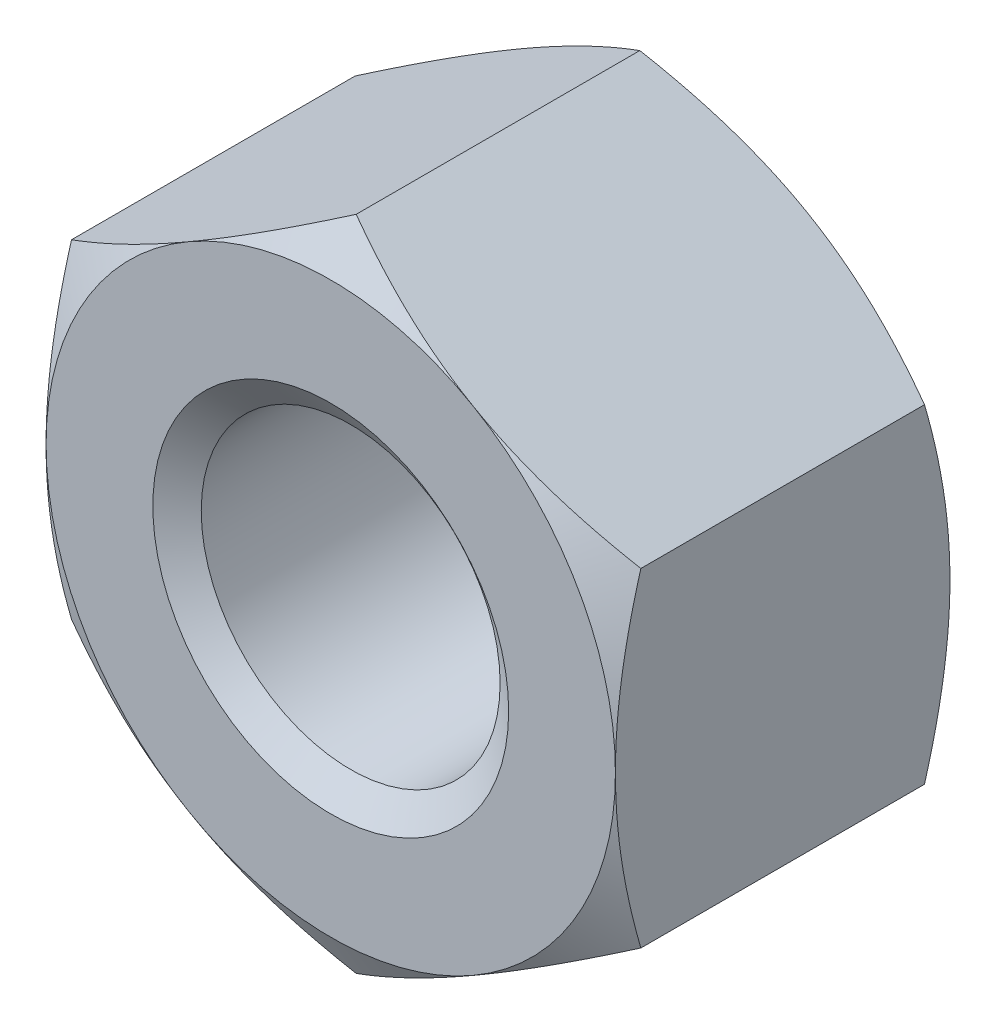
ISO-10303-21;
HEADER;
FILE_DESCRIPTION(('STEP AP214'),'2;1');
FILE_NAME('part.step','',(''),(''),'','','');
FILE_SCHEMA(('AUTOMOTIVE_DESIGN { 1 0 10303 214 1 1 1 1 }'));
ENDSEC;
DATA;
#1=APPLICATION_CONTEXT('core data for automotive mechanical design processes');
#2=APPLICATION_PROTOCOL_DEFINITION('international standard','automotive_design',2000,#1);
#3=PRODUCT_CONTEXT('',#1,'mechanical');
#4=PRODUCT('Part','Part','',(#3));
#5=PRODUCT_RELATED_PRODUCT_CATEGORY('part','',(#4));
#6=PRODUCT_DEFINITION_FORMATION('','',#4);
#7=PRODUCT_DEFINITION_CONTEXT('part definition',#1,'design');
#8=PRODUCT_DEFINITION('design','',#6,#7);
#9=PRODUCT_DEFINITION_SHAPE('','',#8);
#10=(LENGTH_UNIT() NAMED_UNIT(*) SI_UNIT(.MILLI.,.METRE.));
#11=(NAMED_UNIT(*) PLANE_ANGLE_UNIT() SI_UNIT($,.RADIAN.));
#12=(NAMED_UNIT(*) SI_UNIT($,.STERADIAN.) SOLID_ANGLE_UNIT());
#13=UNCERTAINTY_MEASURE_WITH_UNIT(LENGTH_MEASURE(1.E-05),#10,'distance_accuracy_value','');
#14=(GEOMETRIC_REPRESENTATION_CONTEXT(3) GLOBAL_UNCERTAINTY_ASSIGNED_CONTEXT((#13)) GLOBAL_UNIT_ASSIGNED_CONTEXT((#10,
#11,#12)) REPRESENTATION_CONTEXT('',''));
#15=CARTESIAN_POINT('',(0.,0.,0.));
#16=DIRECTION('',(0.,0.,1.));
#17=DIRECTION('',(1.,0.,0.));
#18=AXIS2_PLACEMENT_3D('',#15,#16,#17);
#19=CARTESIAN_POINT('',(0.,0.,-4.7));
#20=DIRECTION('',(0.,0.,1.));
#21=DIRECTION('',(1.,0.,0.));
#22=AXIS2_PLACEMENT_3D('',#19,#20,#21);
#23=CYLINDRICAL_SURFACE('',#22,2.1);
#24=CARTESIAN_POINT('',(0.,0.,-0.280083015283886));
#25=DIRECTION('',(0.,0.,1.));
#26=DIRECTION('',(1.,0.,0.));
#27=AXIS2_PLACEMENT_3D('',#24,#25,#26);
#28=CIRCLE('',#27,2.1);
#29=CARTESIAN_POINT('',(2.1,0.,-0.280083015283886));
#30=VERTEX_POINT('',#29);
#31=EDGE_CURVE('E177',#30,#30,#28,.F.);
#32=ORIENTED_EDGE('',*,*,#31,.F.);
#33=EDGE_LOOP('',(#32));
#34=FACE_BOUND('',#33,.T.);
#35=CARTESIAN_POINT('',(0.,0.,-4.39451698471611));
#36=DIRECTION('',(0.,0.,-1.));
#37=DIRECTION('',(-1.,0.,0.));
#38=AXIS2_PLACEMENT_3D('',#35,#36,#37);
#39=CIRCLE('',#38,2.1);
#40=CARTESIAN_POINT('',(-2.1,0.,-4.39451698471611));
#41=VERTEX_POINT('',#40);
#42=EDGE_CURVE('E41',#41,#41,#39,.F.);
#43=ORIENTED_EDGE('',*,*,#42,.F.);
#44=EDGE_LOOP('',(#43));
#45=FACE_BOUND('',#44,.T.);
#46=ADVANCED_FACE('F36',(#34,#45),#23,.F.);
#47=CARTESIAN_POINT('',(-8.,0.,-4.7));
#48=DIRECTION('',(0.,0.,1.));
#49=DIRECTION('',(1.,0.,0.));
#50=AXIS2_PLACEMENT_3D('',#47,#48,#49);
#51=PLANE('',#50);
#52=CARTESIAN_POINT('',(0.,0.,-4.7));
#53=DIRECTION('',(0.,0.,1.));
#54=DIRECTION('',(1.,0.,0.));
#55=AXIS2_PLACEMENT_3D('',#52,#53,#54);
#56=CIRCLE('',#55,4.);
#57=CARTESIAN_POINT('',(4.,0.,-4.7));
#58=VERTEX_POINT('',#57);
#59=CARTESIAN_POINT('',(2.,3.46410161513776,-4.7));
#60=VERTEX_POINT('',#59);
#61=EDGE_CURVE('E247',#58,#60,#56,.T.);
#62=ORIENTED_EDGE('',*,*,#61,.F.);
#63=CARTESIAN_POINT('',(0.,0.,-4.7));
#64=DIRECTION('',(0.,0.,1.));
#65=DIRECTION('',(1.,0.,0.));
#66=AXIS2_PLACEMENT_3D('',#63,#64,#65);
#67=CIRCLE('',#66,4.);
#68=CARTESIAN_POINT('',(2.,-3.46410161513776,-4.7));
#69=VERTEX_POINT('',#68);
#70=EDGE_CURVE('E171',#58,#69,#67,.F.);
#71=ORIENTED_EDGE('',*,*,#70,.T.);
#72=CARTESIAN_POINT('',(-2.,-3.46410161513776,-4.7));
#73=VERTEX_POINT('',#72);
#74=EDGE_CURVE('E173',#69,#73,#67,.F.);
#75=ORIENTED_EDGE('',*,*,#74,.T.);
#76=CARTESIAN_POINT('',(-4.,0.,-4.7));
#77=VERTEX_POINT('',#76);
#78=EDGE_CURVE('E404',#73,#77,#67,.F.);
#79=ORIENTED_EDGE('',*,*,#78,.T.);
#80=CARTESIAN_POINT('',(-2.,3.46410161513776,-4.7));
#81=VERTEX_POINT('',#80);
#82=EDGE_CURVE('E406',#77,#81,#67,.F.);
#83=ORIENTED_EDGE('',*,*,#82,.T.);
#84=EDGE_CURVE('E155',#81,#60,#67,.F.);
#85=ORIENTED_EDGE('',*,*,#84,.T.);
#86=EDGE_LOOP('',(#62,#71,#75,#79,#83,#85));
#87=FACE_BOUND('',#86,.T.);
#88=CARTESIAN_POINT('',(0.,0.,-4.7));
#89=DIRECTION('',(0.,0.,1.));
#90=DIRECTION('',(1.,0.,0.));
#91=AXIS2_PLACEMENT_3D('',#88,#89,#90);
#92=CIRCLE('',#91,2.5);
#93=CARTESIAN_POINT('',(2.5,0.,-4.7));
#94=VERTEX_POINT('',#93);
#95=EDGE_CURVE('E180',#94,#94,#92,.F.);
#96=ORIENTED_EDGE('',*,*,#95,.F.);
#97=EDGE_LOOP('',(#96));
#98=FACE_BOUND('',#97,.T.);
#99=ADVANCED_FACE('F299',(#87,#98),#51,.F.);
#100=CARTESIAN_POINT('',(-8.,0.,0.));
#101=DIRECTION('',(0.,0.,1.));
#102=DIRECTION('',(1.,0.,0.));
#103=AXIS2_PLACEMENT_3D('',#100,#101,#102);
#104=PLANE('',#103);
#105=CARTESIAN_POINT('',(0.,0.,0.));
#106=DIRECTION('',(0.,0.,1.));
#107=DIRECTION('',(1.,0.,0.));
#108=AXIS2_PLACEMENT_3D('',#105,#106,#107);
#109=CIRCLE('',#108,4.);
#110=CARTESIAN_POINT('',(2.,-3.46410161513775,0.));
#111=VERTEX_POINT('',#110);
#112=CARTESIAN_POINT('',(4.,0.,0.));
#113=VERTEX_POINT('',#112);
#114=EDGE_CURVE('E48',#111,#113,#109,.T.);
#115=ORIENTED_EDGE('',*,*,#114,.T.);
#116=CARTESIAN_POINT('',(0.,0.,0.));
#117=DIRECTION('',(0.,0.,1.));
#118=DIRECTION('',(1.,0.,0.));
#119=AXIS2_PLACEMENT_3D('',#116,#117,#118);
#120=CIRCLE('',#119,4.);
#121=CARTESIAN_POINT('',(2.,3.46410161513775,0.));
#122=VERTEX_POINT('',#121);
#123=EDGE_CURVE('E55',#113,#122,#120,.T.);
#124=ORIENTED_EDGE('',*,*,#123,.T.);
#125=CARTESIAN_POINT('',(-2.,3.46410161513775,0.));
#126=VERTEX_POINT('',#125);
#127=EDGE_CURVE('E11',#122,#126,#109,.T.);
#128=ORIENTED_EDGE('',*,*,#127,.T.);
#129=CARTESIAN_POINT('',(-4.,0.,0.));
#130=VERTEX_POINT('',#129);
#131=EDGE_CURVE('E46',#126,#130,#109,.T.);
#132=ORIENTED_EDGE('',*,*,#131,.T.);
#133=CARTESIAN_POINT('',(-2.,-3.46410161513775,0.));
#134=VERTEX_POINT('',#133);
#135=EDGE_CURVE('E350',#130,#134,#109,.T.);
#136=ORIENTED_EDGE('',*,*,#135,.T.);
#137=EDGE_CURVE('E176',#134,#111,#109,.T.);
#138=ORIENTED_EDGE('',*,*,#137,.T.);
#139=EDGE_LOOP('',(#115,#124,#128,#132,#136,#138));
#140=FACE_BOUND('',#139,.T.);
#141=CARTESIAN_POINT('',(0.,0.,0.));
#142=DIRECTION('',(0.,0.,1.));
#143=DIRECTION('',(1.,0.,0.));
#144=AXIS2_PLACEMENT_3D('',#141,#142,#143);
#145=CIRCLE('',#144,2.5);
#146=CARTESIAN_POINT('',(2.5,0.,0.));
#147=VERTEX_POINT('',#146);
#148=EDGE_CURVE('E179',#147,#147,#145,.T.);
#149=ORIENTED_EDGE('',*,*,#148,.F.);
#150=EDGE_LOOP('',(#149));
#151=FACE_BOUND('',#150,.T.);
#152=ADVANCED_FACE('F252',(#140,#151),#104,.T.);
#153=CARTESIAN_POINT('',(0.,4.61880215351701,-4.7));
#154=DIRECTION('',(-0.5,0.866025403784439,0.));
#155=DIRECTION('',(-0.866025403784439,-0.5,0.));
#156=AXIS2_PLACEMENT_3D('',#153,#154,#155);
#157=PLANE('',#156);
#158=DIRECTION('',(0.,0.,1.));
#159=VECTOR('',#158,1.);
#160=CARTESIAN_POINT('',(-4.,2.3094010767585,-4.7));
#161=LINE('',#160,#159);
#162=CARTESIAN_POINT('',(-4.,2.3094010767585,-4.34273441009183));
#163=VERTEX_POINT('',#162);
#164=CARTESIAN_POINT('',(-4.,2.3094010767585,-0.357265589908165));
#165=VERTEX_POINT('',#164);
#166=EDGE_CURVE('E167',#163,#165,#161,.T.);
#167=ORIENTED_EDGE('',*,*,#166,.T.);
#168=CARTESIAN_POINT('',(-4.0002,2.30928560670467,-0.357332259074769));
#169=CARTESIAN_POINT('',(-3.82442084967677,2.4107717464617,-0.298717873648284));
#170=CARTESIAN_POINT('',(-3.64712438367362,2.51313390883499,-0.245410321462263));
#171=CARTESIAN_POINT('',(-3.28946140682429,2.71963072479812,-0.152361670746404));
#172=CARTESIAN_POINT('',(-3.10908854102985,2.82376904741904,-0.112653489029704));
#173=CARTESIAN_POINT('',(-2.75057818129721,3.03075510011795,-0.0508422152802789));
#174=CARTESIAN_POINT('',(-2.57249584706486,3.13357098372492,-0.0283277315228883));
#175=CARTESIAN_POINT('',(-2.21549328283349,3.33968651028528,-0.00145062314658122));
#176=CARTESIAN_POINT('',(-2.0365743503559,3.44298540411434,0.00293425857305715));
#177=CARTESIAN_POINT('',(-1.70225715780327,3.63600352522932,-0.00619007293997003));
#178=CARTESIAN_POINT('',(-1.54680884001293,3.72575165335065,-0.0174589539879939));
#179=CARTESIAN_POINT('',(-1.23692494436494,3.90466320392054,-0.053173990798193));
#180=CARTESIAN_POINT('',(-1.08249043825587,3.99382600759478,-0.0776323457115331));
#181=CARTESIAN_POINT('',(-0.771967672225421,4.17310641015197,-0.13877606491929));
#182=CARTESIAN_POINT('',(-0.615918711936897,4.26320131938131,-0.175720603654864));
#183=CARTESIAN_POINT('',(-0.30614816459616,4.4420474282755,-0.259570072548028));
#184=CARTESIAN_POINT('',(-0.15242260922622,4.53080091904966,-0.306455302212742));
#185=CARTESIAN_POINT('',(0.000200000000000571,4.61891762357084,-0.357332259074769));
#186=B_SPLINE_CURVE_WITH_KNOTS('',3,(#168,#169,#170,#171,#172,#173,#174,#175,#176,#177,#178,
#179,#180,#181,#182,#183,#184,#185),.UNSPECIFIED.,.F.,.F.,(4,2,2,2,2,2,2,2,4),(0.,
0.634047835695967,1.26961969224544,1.88946157213122,2.50854226669297,3.04757825393386,
3.58711366126903,4.13861653143764,4.68903648037743),.UNSPECIFIED.);
#187=EDGE_CURVE('E63',#165,#126,#186,.T.);
#188=ORIENTED_EDGE('',*,*,#187,.T.);
#189=CARTESIAN_POINT('',(0.,4.61880215351701,-0.357265589908165));
#190=VERTEX_POINT('',#189);
#191=EDGE_CURVE('E241',#126,#190,#186,.T.);
#192=ORIENTED_EDGE('',*,*,#191,.T.);
#193=DIRECTION('',(0.,0.,1.));
#194=VECTOR('',#193,1.);
#195=CARTESIAN_POINT('',(0.,4.61880215351701,-4.7));
#196=LINE('',#195,#194);
#197=CARTESIAN_POINT('',(0.,4.61880215351701,-4.34273441009183));
#198=VERTEX_POINT('',#197);
#199=EDGE_CURVE('E152',#198,#190,#196,.T.);
#200=ORIENTED_EDGE('',*,*,#199,.F.);
#201=CARTESIAN_POINT('',(-4.0002,2.30928560670467,-4.34266774092523));
#202=CARTESIAN_POINT('',(-3.82442084967677,2.4107717464617,-4.40128212635172));
#203=CARTESIAN_POINT('',(-3.64712438367362,2.51313390883499,-4.45458967853774));
#204=CARTESIAN_POINT('',(-3.28946140682429,2.71963072479812,-4.5476383292536));
#205=CARTESIAN_POINT('',(-3.10908854102985,2.82376904741904,-4.5873465109703));
#206=CARTESIAN_POINT('',(-2.75057818129721,3.03075510011795,-4.64915778471972));
#207=CARTESIAN_POINT('',(-2.57249584706486,3.13357098372492,-4.67167226847711));
#208=CARTESIAN_POINT('',(-2.21549328283349,3.33968651028528,-4.69854937685342));
#209=CARTESIAN_POINT('',(-2.0365743503559,3.44298540411434,-4.70293425857306));
#210=CARTESIAN_POINT('',(-1.70225715780327,3.63600352522932,-4.69380992706003));
#211=CARTESIAN_POINT('',(-1.54680884001293,3.72575165335065,-4.68254104601201));
#212=CARTESIAN_POINT('',(-1.23692494436494,3.90466320392054,-4.64682600920181));
#213=CARTESIAN_POINT('',(-1.08249043825587,3.99382600759478,-4.62236765428847));
#214=CARTESIAN_POINT('',(-0.77196767222542,4.17310641015197,-4.56122393508071));
#215=CARTESIAN_POINT('',(-0.615918711936896,4.26320131938131,-4.52427939634514));
#216=CARTESIAN_POINT('',(-0.30614816459616,4.4420474282755,-4.44042992745197));
#217=CARTESIAN_POINT('',(-0.15242260922622,4.53080091904966,-4.39354469778726));
#218=CARTESIAN_POINT('',(0.000200000000000409,4.61891762357084,-4.34266774092523));
#219=B_SPLINE_CURVE_WITH_KNOTS('',3,(#201,#202,#203,#204,#205,#206,#207,#208,#209,#210,#211,
#212,#213,#214,#215,#216,#217,#218),.UNSPECIFIED.,.F.,.F.,(4,2,2,2,2,2,2,2,4),(0.,
0.634047835695967,1.26961969224544,1.88946157213122,2.50854226669297,3.04757825393386,
3.58711366126904,4.13861653143764,4.68903648037743),.UNSPECIFIED.);
#220=EDGE_CURVE('E170',#81,#198,#219,.T.);
#221=ORIENTED_EDGE('',*,*,#220,.F.);
#222=EDGE_CURVE('E262',#163,#81,#219,.T.);
#223=ORIENTED_EDGE('',*,*,#222,.F.);
#224=EDGE_LOOP('',(#167,#188,#192,#200,#221,#223));
#225=FACE_BOUND('',#224,.T.);
#226=ADVANCED_FACE('F38',(#225),#157,.T.);
#227=CARTESIAN_POINT('',(4.,2.3094010767585,-4.7));
#228=DIRECTION('',(0.5,0.866025403784439,0.));
#229=DIRECTION('',(-0.866025403784439,0.5,0.));
#230=AXIS2_PLACEMENT_3D('',#227,#228,#229);
#231=PLANE('',#230);
#232=ORIENTED_EDGE('',*,*,#199,.T.);
#233=CARTESIAN_POINT('',(-0.000199999999999552,4.61891762357084,-0.357332259074769));
#234=CARTESIAN_POINT('',(0.175579150323228,4.5174314838138,-0.298717873648284));
#235=CARTESIAN_POINT('',(0.352875616326381,4.41506932144052,-0.245410321462264));
#236=CARTESIAN_POINT('',(0.710538593175707,4.20857250547739,-0.152361670746404));
#237=CARTESIAN_POINT('',(0.890911458970152,4.10443418285647,-0.112653489029705));
#238=CARTESIAN_POINT('',(1.24942181870279,3.89744813015756,-0.0508422152802788));
#239=CARTESIAN_POINT('',(1.42750415293514,3.79463224655059,-0.0283277315228881));
#240=CARTESIAN_POINT('',(1.78450671716651,3.58851671999023,-0.001450623146581));
#241=CARTESIAN_POINT('',(1.9634256496441,3.48521782616117,0.00293425857305713));
#242=CARTESIAN_POINT('',(2.29774284219673,3.29219970504619,-0.00619007293997014));
#243=CARTESIAN_POINT('',(2.45319115998707,3.20245157692486,-0.017458953987994));
#244=CARTESIAN_POINT('',(2.76307505563506,3.02354002635497,-0.0531739907981928));
#245=CARTESIAN_POINT('',(2.91750956174413,2.93437722268072,-0.0776323457115328));
#246=CARTESIAN_POINT('',(3.22803232777458,2.75509682012354,-0.138776064919289));
#247=CARTESIAN_POINT('',(3.3840812880631,2.6650019108942,-0.175720603654864));
#248=CARTESIAN_POINT('',(3.69385183540384,2.48615580200001,-0.259570072548028));
#249=CARTESIAN_POINT('',(3.84757739077378,2.39740231122585,-0.306455302212741));
#250=CARTESIAN_POINT('',(4.0002,2.30928560670466,-0.357332259074768));
#251=B_SPLINE_CURVE_WITH_KNOTS('',3,(#233,#234,#235,#236,#237,#238,#239,#240,#241,#242,#243,
#244,#245,#246,#247,#248,#249,#250),.UNSPECIFIED.,.F.,.F.,(4,2,2,2,2,2,2,2,4),(0.,
0.634047835695967,1.26961969224544,1.88946157213122,2.50854226669297,3.04757825393386,
3.58711366126903,4.13861653143764,4.68903648037743),.UNSPECIFIED.);
#252=EDGE_CURVE('E145',#190,#122,#251,.T.);
#253=ORIENTED_EDGE('',*,*,#252,.T.);
#254=CARTESIAN_POINT('',(4.,2.3094010767585,-0.357265589908165));
#255=VERTEX_POINT('',#254);
#256=EDGE_CURVE('E131',#122,#255,#251,.T.);
#257=ORIENTED_EDGE('',*,*,#256,.T.);
#258=DIRECTION('',(0.,0.,1.));
#259=VECTOR('',#258,1.);
#260=CARTESIAN_POINT('',(4.,2.3094010767585,-4.7));
#261=LINE('',#260,#259);
#262=CARTESIAN_POINT('',(4.,2.3094010767585,-4.34273441009183));
#263=VERTEX_POINT('',#262);
#264=EDGE_CURVE('E144',#263,#255,#261,.T.);
#265=ORIENTED_EDGE('',*,*,#264,.F.);
#266=CARTESIAN_POINT('',(-0.000199999999999567,4.61891762357084,-4.34266774092523));
#267=CARTESIAN_POINT('',(0.175579150323228,4.5174314838138,-4.40128212635172));
#268=CARTESIAN_POINT('',(0.352875616326381,4.41506932144052,-4.45458967853774));
#269=CARTESIAN_POINT('',(0.710538593175707,4.20857250547739,-4.5476383292536));
#270=CARTESIAN_POINT('',(0.890911458970152,4.10443418285647,-4.58734651097029));
#271=CARTESIAN_POINT('',(1.24942181870279,3.89744813015756,-4.64915778471972));
#272=CARTESIAN_POINT('',(1.42750415293514,3.79463224655059,-4.67167226847711));
#273=CARTESIAN_POINT('',(1.78450671716651,3.58851671999023,-4.69854937685342));
#274=CARTESIAN_POINT('',(1.9634256496441,3.48521782616117,-4.70293425857306));
#275=CARTESIAN_POINT('',(2.29774284219674,3.29219970504619,-4.69380992706003));
#276=CARTESIAN_POINT('',(2.45319115998707,3.20245157692486,-4.68254104601201));
#277=CARTESIAN_POINT('',(2.76307505563506,3.02354002635496,-4.64682600920181));
#278=CARTESIAN_POINT('',(2.91750956174413,2.93437722268072,-4.62236765428847));
#279=CARTESIAN_POINT('',(3.22803232777458,2.75509682012354,-4.56122393508071));
#280=CARTESIAN_POINT('',(3.3840812880631,2.6650019108942,-4.52427939634514));
#281=CARTESIAN_POINT('',(3.69385183540384,2.486155802,-4.44042992745197));
#282=CARTESIAN_POINT('',(3.84757739077378,2.39740231122585,-4.39354469778726));
#283=CARTESIAN_POINT('',(4.0002,2.30928560670466,-4.34266774092523));
#284=B_SPLINE_CURVE_WITH_KNOTS('',3,(#266,#267,#268,#269,#270,#271,#272,#273,#274,#275,#276,
#277,#278,#279,#280,#281,#282,#283),.UNSPECIFIED.,.F.,.F.,(4,2,2,2,2,2,2,2,4),(0.,
0.634047835695967,1.26961969224544,1.88946157213122,2.50854226669297,3.04757825393386,
3.58711366126904,4.13861653143764,4.68903648037743),.UNSPECIFIED.);
#285=EDGE_CURVE('E256',#60,#263,#284,.T.);
#286=ORIENTED_EDGE('',*,*,#285,.F.);
#287=EDGE_CURVE('E261',#198,#60,#284,.T.);
#288=ORIENTED_EDGE('',*,*,#287,.F.);
#289=EDGE_LOOP('',(#232,#253,#257,#265,#286,#288));
#290=FACE_BOUND('',#289,.T.);
#291=ADVANCED_FACE('F142',(#290),#231,.T.);
#292=CARTESIAN_POINT('',(4.,2.3094010767585,-4.7));
#293=DIRECTION('',(-1.,0.,0.));
#294=DIRECTION('',(0.,0.,1.));
#295=AXIS2_PLACEMENT_3D('',#292,#293,#294);
#296=PLANE('',#295);
#297=CARTESIAN_POINT('',(4.,-6.12487198995892,-1.91410682124064));
#298=CARTESIAN_POINT('',(4.,-5.94924937038676,-1.8292362707669));
#299=CARTESIAN_POINT('',(4.,-5.77321152095286,-1.7452094038074));
#300=CARTESIAN_POINT('',(4.,-5.42008084777954,-1.57932514679716));
#301=CARTESIAN_POINT('',(4.,-5.24298784779927,-1.49746813236723));
#302=CARTESIAN_POINT('',(4.,-4.88656571686333,-1.33597446305856));
#303=CARTESIAN_POINT('',(4.,-4.70722958889362,-1.25635319506304));
#304=CARTESIAN_POINT('',(4.,-4.34708334747263,-1.1005305854203));
#305=CARTESIAN_POINT('',(4.,-4.16627331143537,-1.02432906550802));
#306=CARTESIAN_POINT('',(4.,-3.80064706744977,-0.875350650394363));
#307=CARTESIAN_POINT('',(4.,-3.6158089282277,-0.802627284215846));
#308=CARTESIAN_POINT('',(4.,-3.24395246794968,-0.66287623095942));
#309=CARTESIAN_POINT('',(4.,-3.05693390695801,-0.595849177566504));
#310=CARTESIAN_POINT('',(4.,-2.6808031825377,-0.469291748430881));
#311=CARTESIAN_POINT('',(4.,-2.49169643712848,-0.409745434783837));
#312=CARTESIAN_POINT('',(4.,-2.11079454635851,-0.300083356544506));
#313=CARTESIAN_POINT('',(4.,-1.91900027185748,-0.249964609676751));
#314=CARTESIAN_POINT('',(4.,-1.532592326982,-0.161590794954041));
#315=CARTESIAN_POINT('',(4.,-1.33797792031649,-0.12333888595654));
#316=CARTESIAN_POINT('',(4.,-0.946402725872551,-0.0612742359223432));
#317=CARTESIAN_POINT('',(4.,-0.749441936019771,-0.0374615076516988));
#318=CARTESIAN_POINT('',(4.,-0.355451989627939,-0.00638181314943622));
#319=CARTESIAN_POINT('',(4.,-0.158431311094008,0.000989900761041354));
#320=CARTESIAN_POINT('',(4.,0.235472085607472,-0.00120406637479588));
#321=CARTESIAN_POINT('',(4.,0.432354826312208,-0.0107653508153512));
#322=CARTESIAN_POINT('',(4.,0.76856063522552,-0.0408787346135915));
#323=CARTESIAN_POINT('',(4.,0.908254618381823,-0.0575092960439108));
#324=CARTESIAN_POINT('',(4.,1.18656349063498,-0.0982134103466931));
#325=CARTESIAN_POINT('',(4.,1.32517820601014,-0.122288137058448));
#326=CARTESIAN_POINT('',(4.,1.7392904545297,-0.204415070950233));
#327=CARTESIAN_POINT('',(4.,2.01284690528723,-0.272348886425156));
#328=CARTESIAN_POINT('',(4.,2.42218253014524,-0.389516359317206));
#329=CARTESIAN_POINT('',(4.,2.56009536361539,-0.431713941811639));
#330=CARTESIAN_POINT('',(4.,2.83448159101404,-0.520284580227766));
#331=CARTESIAN_POINT('',(4.,2.97095590623558,-0.566654756186916));
#332=CARTESIAN_POINT('',(4.,3.24189440516341,-0.66260569918029));
#333=CARTESIAN_POINT('',(4.,3.37636557946839,-0.712166925753504));
#334=CARTESIAN_POINT('',(4.,3.64426461152914,-0.814198353790706));
#335=CARTESIAN_POINT('',(4.,3.77769202239388,-0.866669730963373));
#336=CARTESIAN_POINT('',(4.,3.91063698986685,-0.920309006541796));
#337=B_SPLINE_CURVE_WITH_KNOTS('',3,(#297,#298,#299,#300,#301,#302,#303,#304,#305,#306,#307,
#308,#309,#310,#311,#312,#313,#314,#315,#316,#317,#318,#319,#320,#321,#322,#323,#324,#325,#326,
#327,#328,#329,#330,#331,#332,#333,#334,#335,#336),.UNSPECIFIED.,.F.,.F.,(4,2,2,2,2,2,2,2,2,2,2,
2,2,2,2,2,2,2,2,4),(0.,0.585171792532272,1.17044423059927,1.7590659464599,2.34765694284827,
2.94347400997483,3.53935727210689,4.13394864697601,4.72835161391471,5.32291267067845,
5.91747425310813,6.50823685854037,7.09884609659886,7.52068140825521,7.9425832713084,
8.7870149135983,9.2196528189769,9.65199437116298,10.0819024146297,10.5119854255247),.UNSPECIFIED.);
#338=CARTESIAN_POINT('',(4.,-2.30940107675851,-0.357265589908165));
#339=VERTEX_POINT('',#338);
#340=EDGE_CURVE('E137',#339,#113,#337,.T.);
#341=ORIENTED_EDGE('',*,*,#340,.F.);
#342=DIRECTION('',(0.,0.,1.));
#343=VECTOR('',#342,1.);
#344=CARTESIAN_POINT('',(4.,-2.3094010767585,-4.7));
#345=LINE('',#344,#343);
#346=CARTESIAN_POINT('',(4.,-2.30940107675851,-4.34273441009183));
#347=VERTEX_POINT('',#346);
#348=EDGE_CURVE('E153',#347,#339,#345,.T.);
#349=ORIENTED_EDGE('',*,*,#348,.F.);
#350=CARTESIAN_POINT('',(4.,-6.12487198995892,-2.78589317875935));
#351=CARTESIAN_POINT('',(4.,-5.94924937038676,-2.87076372923309));
#352=CARTESIAN_POINT('',(4.,-5.77321152095286,-2.9547905961926));
#353=CARTESIAN_POINT('',(4.,-5.42008084777954,-3.12067485320283));
#354=CARTESIAN_POINT('',(4.,-5.24298784779927,-3.20253186763276));
#355=CARTESIAN_POINT('',(4.,-4.88656571686333,-3.36402553694144));
#356=CARTESIAN_POINT('',(4.,-4.70722958889362,-3.44364680493696));
#357=CARTESIAN_POINT('',(4.,-4.34708334747263,-3.5994694145797));
#358=CARTESIAN_POINT('',(4.,-4.16627331143537,-3.67567093449198));
#359=CARTESIAN_POINT('',(4.,-3.80064706744977,-3.82464934960564));
#360=CARTESIAN_POINT('',(4.,-3.6158089282277,-3.89737271578415));
#361=CARTESIAN_POINT('',(4.,-3.24395246794968,-4.03712376904058));
#362=CARTESIAN_POINT('',(4.,-3.05693390695801,-4.10415082243349));
#363=CARTESIAN_POINT('',(4.,-2.6808031825377,-4.23070825156912));
#364=CARTESIAN_POINT('',(4.,-2.49169643712848,-4.29025456521616));
#365=CARTESIAN_POINT('',(4.,-2.11079454635851,-4.39991664345549));
#366=CARTESIAN_POINT('',(4.,-1.91900027185748,-4.45003539032325));
#367=CARTESIAN_POINT('',(4.,-1.532592326982,-4.53840920504596));
#368=CARTESIAN_POINT('',(4.,-1.33797792031649,-4.57666111404346));
#369=CARTESIAN_POINT('',(4.,-0.946402725872551,-4.63872576407766));
#370=CARTESIAN_POINT('',(4.,-0.749441936019771,-4.6625384923483));
#371=CARTESIAN_POINT('',(4.,-0.355451989627939,-4.69361818685056));
#372=CARTESIAN_POINT('',(4.,-0.158431311094008,-4.70098990076104));
#373=CARTESIAN_POINT('',(4.,0.235472085607472,-4.6987959336252));
#374=CARTESIAN_POINT('',(4.,0.432354826312209,-4.68923464918465));
#375=CARTESIAN_POINT('',(4.,0.76856063522552,-4.65912126538641));
#376=CARTESIAN_POINT('',(4.,0.908254618381822,-4.64249070395609));
#377=CARTESIAN_POINT('',(4.,1.18656349063497,-4.60178658965331));
#378=CARTESIAN_POINT('',(4.,1.32517820601013,-4.57771186294155));
#379=CARTESIAN_POINT('',(4.,1.73929045452969,-4.49558492904977));
#380=CARTESIAN_POINT('',(4.,2.01284690528722,-4.42765111357484));
#381=CARTESIAN_POINT('',(4.,2.42218253014524,-4.3104836406828));
#382=CARTESIAN_POINT('',(4.,2.56009536361538,-4.26828605818836));
#383=CARTESIAN_POINT('',(4.,2.83448159101403,-4.17971541977224));
#384=CARTESIAN_POINT('',(4.,2.97095590623557,-4.13334524381309));
#385=CARTESIAN_POINT('',(4.,3.2418944051634,-4.03739430081971));
#386=CARTESIAN_POINT('',(4.,3.37636557946837,-3.9878330742465));
#387=CARTESIAN_POINT('',(4.,3.64426461152913,-3.8858016462093));
#388=CARTESIAN_POINT('',(4.,3.77769202239386,-3.83333026903663));
#389=CARTESIAN_POINT('',(4.,3.91063698986683,-3.77969099345821));
#390=B_SPLINE_CURVE_WITH_KNOTS('',3,(#350,#351,#352,#353,#354,#355,#356,#357,#358,#359,#360,
#361,#362,#363,#364,#365,#366,#367,#368,#369,#370,#371,#372,#373,#374,#375,#376,#377,#378,#379,
#380,#381,#382,#383,#384,#385,#386,#387,#388,#389),.UNSPECIFIED.,.F.,.F.,(4,2,2,2,2,2,2,2,2,2,2,
2,2,2,2,2,2,2,2,4),(0.,0.585171792532271,1.17044423059927,1.7590659464599,2.34765694284827,
2.94347400997483,3.53935727210689,4.13394864697601,4.72835161391471,5.32291267067845,
5.91747425310813,6.50823685854037,7.09884609659887,7.52068140825521,7.9425832713084,
8.78701491359829,9.21965281897689,9.65199437116297,10.0819024146297,10.5119854255247),.UNSPECIFIED.);
#391=EDGE_CURVE('E267',#347,#58,#390,.T.);
#392=ORIENTED_EDGE('',*,*,#391,.T.);
#393=EDGE_CURVE('E151',#58,#263,#390,.T.);
#394=ORIENTED_EDGE('',*,*,#393,.T.);
#395=ORIENTED_EDGE('',*,*,#264,.T.);
#396=EDGE_CURVE('E128',#113,#255,#337,.T.);
#397=ORIENTED_EDGE('',*,*,#396,.F.);
#398=EDGE_LOOP('',(#341,#349,#392,#394,#395,#397));
#399=FACE_BOUND('',#398,.T.);
#400=ADVANCED_FACE('F148',(#399),#296,.F.);
#401=CARTESIAN_POINT('',(0.,-4.61880215351701,-4.7));
#402=DIRECTION('',(0.5,-0.866025403784439,0.));
#403=DIRECTION('',(0.866025403784439,0.5,0.));
#404=AXIS2_PLACEMENT_3D('',#401,#402,#403);
#405=PLANE('',#404);
#406=ORIENTED_EDGE('',*,*,#348,.T.);
#407=CARTESIAN_POINT('',(4.0002,-2.30928560670467,-0.357332259074769));
#408=CARTESIAN_POINT('',(3.82442084967677,-2.41077174646171,-0.298717873648284));
#409=CARTESIAN_POINT('',(3.64712438367362,-2.513133908835,-0.245410321462264));
#410=CARTESIAN_POINT('',(3.28946140682429,-2.71963072479812,-0.152361670746404));
#411=CARTESIAN_POINT('',(3.10908854102985,-2.82376904741904,-0.112653489029704));
#412=CARTESIAN_POINT('',(2.75057818129721,-3.03075510011795,-0.0508422152802789));
#413=CARTESIAN_POINT('',(2.57249584706486,-3.13357098372492,-0.0283277315228887));
#414=CARTESIAN_POINT('',(2.21549328283349,-3.33968651028528,-0.00145062314658184));
#415=CARTESIAN_POINT('',(2.0365743503559,-3.44298540411434,0.00293425857305661));
#416=CARTESIAN_POINT('',(1.70225715780327,-3.63600352522932,-0.00619007293997062));
#417=CARTESIAN_POINT('',(1.54680884001293,-3.72575165335065,-0.0174589539879946));
#418=CARTESIAN_POINT('',(1.23692494436494,-3.90466320392054,-0.0531739907981937));
#419=CARTESIAN_POINT('',(1.08249043825587,-3.99382600759478,-0.0776323457115337));
#420=CARTESIAN_POINT('',(0.771967672225421,-4.17310641015197,-0.13877606491929));
#421=CARTESIAN_POINT('',(0.615918711936897,-4.26320131938131,-0.175720603654865));
#422=CARTESIAN_POINT('',(0.306148164596161,-4.4420474282755,-0.259570072548029));
#423=CARTESIAN_POINT('',(0.152422609226221,-4.53080091904966,-0.306455302212742));
#424=CARTESIAN_POINT('',(-0.000200000000000239,-4.61891762357085,-0.357332259074769));
#425=B_SPLINE_CURVE_WITH_KNOTS('',3,(#407,#408,#409,#410,#411,#412,#413,#414,#415,#416,#417,
#418,#419,#420,#421,#422,#423,#424),.UNSPECIFIED.,.F.,.F.,(4,2,2,2,2,2,2,2,4),(0.,
0.634047835695967,1.26961969224544,1.88946157213122,2.50854226669297,3.04757825393386,
3.58711366126903,4.13861653143764,4.68903648037743),.UNSPECIFIED.);
#426=EDGE_CURVE('E338',#339,#111,#425,.T.);
#427=ORIENTED_EDGE('',*,*,#426,.T.);
#428=CARTESIAN_POINT('',(0.,-4.61880215351701,-0.357265589908165));
#429=VERTEX_POINT('',#428);
#430=EDGE_CURVE('E228',#111,#429,#425,.T.);
#431=ORIENTED_EDGE('',*,*,#430,.T.);
#432=DIRECTION('',(0.,0.,1.));
#433=VECTOR('',#432,1.);
#434=CARTESIAN_POINT('',(0.,-4.61880215351701,-4.7));
#435=LINE('',#434,#433);
#436=CARTESIAN_POINT('',(0.,-4.61880215351701,-4.34273441009183));
#437=VERTEX_POINT('',#436);
#438=EDGE_CURVE('E158',#437,#429,#435,.T.);
#439=ORIENTED_EDGE('',*,*,#438,.F.);
#440=CARTESIAN_POINT('',(4.0002,-2.30928560670467,-4.34266774092523));
#441=CARTESIAN_POINT('',(3.82442084967677,-2.41077174646171,-4.40128212635172));
#442=CARTESIAN_POINT('',(3.64712438367362,-2.513133908835,-4.45458967853774));
#443=CARTESIAN_POINT('',(3.28946140682429,-2.71963072479812,-4.5476383292536));
#444=CARTESIAN_POINT('',(3.10908854102985,-2.82376904741904,-4.5873465109703));
#445=CARTESIAN_POINT('',(2.75057818129721,-3.03075510011795,-4.64915778471972));
#446=CARTESIAN_POINT('',(2.57249584706486,-3.13357098372492,-4.67167226847711));
#447=CARTESIAN_POINT('',(2.21549328283349,-3.33968651028528,-4.69854937685342));
#448=CARTESIAN_POINT('',(2.0365743503559,-3.44298540411434,-4.70293425857306));
#449=CARTESIAN_POINT('',(1.70225715780327,-3.63600352522933,-4.69380992706003));
#450=CARTESIAN_POINT('',(1.54680884001293,-3.72575165335065,-4.68254104601201));
#451=CARTESIAN_POINT('',(1.23692494436494,-3.90466320392054,-4.64682600920181));
#452=CARTESIAN_POINT('',(1.08249043825587,-3.99382600759479,-4.62236765428847));
#453=CARTESIAN_POINT('',(0.77196767222542,-4.17310641015197,-4.56122393508071));
#454=CARTESIAN_POINT('',(0.615918711936896,-4.26320131938131,-4.52427939634514));
#455=CARTESIAN_POINT('',(0.306148164596159,-4.4420474282755,-4.44042992745197));
#456=CARTESIAN_POINT('',(0.15242260922622,-4.53080091904966,-4.39354469778726));
#457=CARTESIAN_POINT('',(-0.000200000000000189,-4.61891762357085,-4.34266774092523));
#458=B_SPLINE_CURVE_WITH_KNOTS('',3,(#440,#441,#442,#443,#444,#445,#446,#447,#448,#449,#450,
#451,#452,#453,#454,#455,#456,#457),.UNSPECIFIED.,.F.,.F.,(4,2,2,2,2,2,2,2,4),(0.,
0.634047835695967,1.26961969224544,1.88946157213122,2.50854226669297,3.04757825393386,
3.58711366126904,4.13861653143764,4.68903648037743),.UNSPECIFIED.);
#459=EDGE_CURVE('E273',#69,#437,#458,.T.);
#460=ORIENTED_EDGE('',*,*,#459,.F.);
#461=EDGE_CURVE('E272',#347,#69,#458,.T.);
#462=ORIENTED_EDGE('',*,*,#461,.F.);
#463=EDGE_LOOP('',(#406,#427,#431,#439,#460,#462));
#464=FACE_BOUND('',#463,.T.);
#465=ADVANCED_FACE('F283',(#464),#405,.T.);
#466=CARTESIAN_POINT('',(-4.,-2.3094010767585,-4.7));
#467=DIRECTION('',(-0.5,-0.866025403784439,0.));
#468=DIRECTION('',(0.866025403784439,-0.5,0.));
#469=AXIS2_PLACEMENT_3D('',#466,#467,#468);
#470=PLANE('',#469);
#471=ORIENTED_EDGE('',*,*,#438,.T.);
#472=CARTESIAN_POINT('',(0.00019999999999975,-4.61891762357085,-0.35733225907477));
#473=CARTESIAN_POINT('',(-0.175579150323228,-4.51743148381381,-0.298717873648285));
#474=CARTESIAN_POINT('',(-0.352875616326381,-4.41506932144052,-0.245410321462265));
#475=CARTESIAN_POINT('',(-0.710538593175707,-4.20857250547739,-0.152361670746404));
#476=CARTESIAN_POINT('',(-0.890911458970152,-4.10443418285647,-0.112653489029705));
#477=CARTESIAN_POINT('',(-1.24942181870279,-3.89744813015756,-0.0508422152802788));
#478=CARTESIAN_POINT('',(-1.42750415293514,-3.79463224655059,-0.0283277315228886));
#479=CARTESIAN_POINT('',(-1.78450671716651,-3.58851671999023,-0.00145062314658148));
#480=CARTESIAN_POINT('',(-1.9634256496441,-3.48521782616117,0.00293425857305713));
#481=CARTESIAN_POINT('',(-2.29774284219674,-3.29219970504619,-0.00619007293997013));
#482=CARTESIAN_POINT('',(-2.45319115998707,-3.20245157692486,-0.0174589539879943));
#483=CARTESIAN_POINT('',(-2.76307505563506,-3.02354002635497,-0.0531739907981935));
#484=CARTESIAN_POINT('',(-2.91750956174413,-2.93437722268072,-0.0776323457115336));
#485=CARTESIAN_POINT('',(-3.22803232777458,-2.75509682012354,-0.13877606491929));
#486=CARTESIAN_POINT('',(-3.3840812880631,-2.6650019108942,-0.175720603654865));
#487=CARTESIAN_POINT('',(-3.69385183540384,-2.48615580200001,-0.259570072548028));
#488=CARTESIAN_POINT('',(-3.84757739077378,-2.39740231122585,-0.306455302212742));
#489=CARTESIAN_POINT('',(-4.0002,-2.30928560670467,-0.357332259074768));
#490=B_SPLINE_CURVE_WITH_KNOTS('',3,(#472,#473,#474,#475,#476,#477,#478,#479,#480,#481,#482,
#483,#484,#485,#486,#487,#488,#489),.UNSPECIFIED.,.F.,.F.,(4,2,2,2,2,2,2,2,4),(0.,
0.634047835695967,1.26961969224544,1.88946157213122,2.50854226669297,3.04757825393386,
3.58711366126904,4.13861653143764,4.68903648037743),.UNSPECIFIED.);
#491=EDGE_CURVE('E341',#429,#134,#490,.T.);
#492=ORIENTED_EDGE('',*,*,#491,.T.);
#493=CARTESIAN_POINT('',(-4.,-2.3094010767585,-0.357265589908165));
#494=VERTEX_POINT('',#493);
#495=EDGE_CURVE('E201',#134,#494,#490,.T.);
#496=ORIENTED_EDGE('',*,*,#495,.T.);
#497=DIRECTION('',(0.,0.,1.));
#498=VECTOR('',#497,1.);
#499=CARTESIAN_POINT('',(-4.,-2.3094010767585,-4.7));
#500=LINE('',#499,#498);
#501=CARTESIAN_POINT('',(-4.,-2.3094010767585,-4.34273441009183));
#502=VERTEX_POINT('',#501);
#503=EDGE_CURVE('E164',#502,#494,#500,.T.);
#504=ORIENTED_EDGE('',*,*,#503,.F.);
#505=CARTESIAN_POINT('',(0.00019999999999975,-4.61891762357085,-4.34266774092523));
#506=CARTESIAN_POINT('',(-0.175579150323229,-4.51743148381381,-4.40128212635172));
#507=CARTESIAN_POINT('',(-0.352875616326381,-4.41506932144052,-4.45458967853774));
#508=CARTESIAN_POINT('',(-0.710538593175707,-4.20857250547739,-4.5476383292536));
#509=CARTESIAN_POINT('',(-0.890911458970152,-4.10443418285647,-4.5873465109703));
#510=CARTESIAN_POINT('',(-1.24942181870279,-3.89744813015756,-4.64915778471972));
#511=CARTESIAN_POINT('',(-1.42750415293514,-3.79463224655059,-4.67167226847711));
#512=CARTESIAN_POINT('',(-1.78450671716651,-3.58851671999023,-4.69854937685342));
#513=CARTESIAN_POINT('',(-1.9634256496441,-3.48521782616117,-4.70293425857306));
#514=CARTESIAN_POINT('',(-2.29774284219674,-3.29219970504619,-4.69380992706003));
#515=CARTESIAN_POINT('',(-2.45319115998707,-3.20245157692486,-4.68254104601201));
#516=CARTESIAN_POINT('',(-2.76307505563506,-3.02354002635497,-4.64682600920181));
#517=CARTESIAN_POINT('',(-2.91750956174413,-2.93437722268072,-4.62236765428847));
#518=CARTESIAN_POINT('',(-3.22803232777458,-2.75509682012354,-4.56122393508071));
#519=CARTESIAN_POINT('',(-3.3840812880631,-2.6650019108942,-4.52427939634514));
#520=CARTESIAN_POINT('',(-3.69385183540384,-2.48615580200001,-4.44042992745197));
#521=CARTESIAN_POINT('',(-3.84757739077378,-2.39740231122585,-4.39354469778726));
#522=CARTESIAN_POINT('',(-4.0002,-2.30928560670467,-4.34266774092523));
#523=B_SPLINE_CURVE_WITH_KNOTS('',3,(#505,#506,#507,#508,#509,#510,#511,#512,#513,#514,#515,
#516,#517,#518,#519,#520,#521,#522),.UNSPECIFIED.,.F.,.F.,(4,2,2,2,2,2,2,2,4),(0.,
0.634047835695967,1.26961969224544,1.88946157213122,2.50854226669298,3.04757825393386,
3.58711366126904,4.13861653143764,4.68903648037743),.UNSPECIFIED.);
#524=EDGE_CURVE('E279',#73,#502,#523,.T.);
#525=ORIENTED_EDGE('',*,*,#524,.F.);
#526=EDGE_CURVE('E278',#437,#73,#523,.T.);
#527=ORIENTED_EDGE('',*,*,#526,.F.);
#528=EDGE_LOOP('',(#471,#492,#496,#504,#525,#527));
#529=FACE_BOUND('',#528,.T.);
#530=ADVANCED_FACE('F286',(#529),#470,.T.);
#531=CARTESIAN_POINT('',(-4.,2.3094010767585,-4.7));
#532=DIRECTION('',(-1.,0.,0.));
#533=DIRECTION('',(0.,0.,1.));
#534=AXIS2_PLACEMENT_3D('',#531,#532,#533);
#535=PLANE('',#534);
#536=ORIENTED_EDGE('',*,*,#503,.T.);
#537=CARTESIAN_POINT('',(-4.,-6.12487198995892,-1.91410682124064));
#538=CARTESIAN_POINT('',(-4.,-5.94924937038676,-1.8292362707669));
#539=CARTESIAN_POINT('',(-4.,-5.77321152095286,-1.7452094038074));
#540=CARTESIAN_POINT('',(-4.,-5.42008084777954,-1.57932514679716));
#541=CARTESIAN_POINT('',(-4.,-5.24298784779927,-1.49746813236723));
#542=CARTESIAN_POINT('',(-4.,-4.88656571686333,-1.33597446305856));
#543=CARTESIAN_POINT('',(-4.,-4.70722958889362,-1.25635319506304));
#544=CARTESIAN_POINT('',(-4.,-4.34708334747263,-1.1005305854203));
#545=CARTESIAN_POINT('',(-4.,-4.16627331143537,-1.02432906550802));
#546=CARTESIAN_POINT('',(-4.,-3.80064706744977,-0.875350650394362));
#547=CARTESIAN_POINT('',(-4.,-3.61580892822769,-0.802627284215845));
#548=CARTESIAN_POINT('',(-4.,-3.24395246794968,-0.662876230959419));
#549=CARTESIAN_POINT('',(-4.,-3.05693390695801,-0.595849177566504));
#550=CARTESIAN_POINT('',(-4.,-2.6808031825377,-0.469291748430881));
#551=CARTESIAN_POINT('',(-4.,-2.49169643712848,-0.409745434783837));
#552=CARTESIAN_POINT('',(-4.,-2.11079454635851,-0.300083356544506));
#553=CARTESIAN_POINT('',(-4.,-1.91900027185748,-0.249964609676751));
#554=CARTESIAN_POINT('',(-4.,-1.53259232698199,-0.161590794954041));
#555=CARTESIAN_POINT('',(-4.,-1.33797792031649,-0.123338885956539));
#556=CARTESIAN_POINT('',(-4.,-0.94640272587255,-0.0612742359223427));
#557=CARTESIAN_POINT('',(-4.,-0.74944193601977,-0.0374615076516982));
#558=CARTESIAN_POINT('',(-4.,-0.355451989627939,-0.00638181314943584));
#559=CARTESIAN_POINT('',(-4.,-0.158431311094007,0.000989900761041439));
#560=CARTESIAN_POINT('',(-4.,0.235472085607472,-0.00120406637479597));
#561=CARTESIAN_POINT('',(-4.,0.432354826312209,-0.0107653508153512));
#562=CARTESIAN_POINT('',(-4.,0.768560635225521,-0.0408787346135915));
#563=CARTESIAN_POINT('',(-4.,0.908254618381823,-0.0575092960439108));
#564=CARTESIAN_POINT('',(-4.,1.18656349063498,-0.0982134103466931));
#565=CARTESIAN_POINT('',(-4.,1.32517820601014,-0.122288137058448));
#566=CARTESIAN_POINT('',(-4.,1.7392904545297,-0.204415070950233));
#567=CARTESIAN_POINT('',(-4.,2.01284690528723,-0.272348886425156));
#568=CARTESIAN_POINT('',(-4.,2.42218253014524,-0.389516359317206));
#569=CARTESIAN_POINT('',(-4.,2.56009536361539,-0.431713941811639));
#570=CARTESIAN_POINT('',(-4.,2.83448159101404,-0.520284580227766));
#571=CARTESIAN_POINT('',(-4.,2.97095590623558,-0.566654756186916));
#572=CARTESIAN_POINT('',(-4.,3.24189440516341,-0.66260569918029));
#573=CARTESIAN_POINT('',(-4.,3.37636557946839,-0.712166925753504));
#574=CARTESIAN_POINT('',(-4.,3.64426461152914,-0.814198353790706));
#575=CARTESIAN_POINT('',(-4.,3.77769202239388,-0.866669730963374));
#576=CARTESIAN_POINT('',(-4.,3.91063698986685,-0.920309006541796));
#577=B_SPLINE_CURVE_WITH_KNOTS('',3,(#537,#538,#539,#540,#541,#542,#543,#544,#545,#546,#547,
#548,#549,#550,#551,#552,#553,#554,#555,#556,#557,#558,#559,#560,#561,#562,#563,#564,#565,#566,
#567,#568,#569,#570,#571,#572,#573,#574,#575,#576),.UNSPECIFIED.,.F.,.F.,(4,2,2,2,2,2,2,2,2,2,2,
2,2,2,2,2,2,2,2,4),(0.,0.585171792532271,1.17044423059927,1.7590659464599,2.34765694284827,
2.94347400997483,3.53935727210689,4.133948646976,4.72835161391471,5.32291267067845,
5.91747425310813,6.50823685854036,7.09884609659886,7.52068140825521,7.9425832713084,
8.7870149135983,9.21965281897689,9.65199437116298,10.0819024146297,10.5119854255247),.UNSPECIFIED.);
#578=EDGE_CURVE('E200',#494,#130,#577,.T.);
#579=ORIENTED_EDGE('',*,*,#578,.T.);
#580=EDGE_CURVE('E194',#130,#165,#577,.T.);
#581=ORIENTED_EDGE('',*,*,#580,.T.);
#582=ORIENTED_EDGE('',*,*,#166,.F.);
#583=CARTESIAN_POINT('',(-4.,-6.12487198995892,-2.78589317875935));
#584=CARTESIAN_POINT('',(-4.,-5.94924937038676,-2.8707637292331));
#585=CARTESIAN_POINT('',(-4.,-5.77321152095286,-2.9547905961926));
#586=CARTESIAN_POINT('',(-4.,-5.42008084777954,-3.12067485320283));
#587=CARTESIAN_POINT('',(-4.,-5.24298784779927,-3.20253186763276));
#588=CARTESIAN_POINT('',(-4.,-4.88656571686333,-3.36402553694144));
#589=CARTESIAN_POINT('',(-4.,-4.70722958889362,-3.44364680493696));
#590=CARTESIAN_POINT('',(-4.,-4.34708334747263,-3.5994694145797));
#591=CARTESIAN_POINT('',(-4.,-4.16627331143537,-3.67567093449198));
#592=CARTESIAN_POINT('',(-4.,-3.80064706744977,-3.82464934960564));
#593=CARTESIAN_POINT('',(-4.,-3.61580892822769,-3.89737271578415));
#594=CARTESIAN_POINT('',(-4.,-3.24395246794968,-4.03712376904058));
#595=CARTESIAN_POINT('',(-4.,-3.05693390695801,-4.10415082243349));
#596=CARTESIAN_POINT('',(-4.,-2.6808031825377,-4.23070825156912));
#597=CARTESIAN_POINT('',(-4.,-2.49169643712848,-4.29025456521616));
#598=CARTESIAN_POINT('',(-4.,-2.11079454635851,-4.39991664345549));
#599=CARTESIAN_POINT('',(-4.,-1.91900027185748,-4.45003539032325));
#600=CARTESIAN_POINT('',(-4.,-1.532592326982,-4.53840920504596));
#601=CARTESIAN_POINT('',(-4.,-1.33797792031649,-4.57666111404346));
#602=CARTESIAN_POINT('',(-4.,-0.94640272587255,-4.63872576407766));
#603=CARTESIAN_POINT('',(-4.,-0.74944193601977,-4.6625384923483));
#604=CARTESIAN_POINT('',(-4.,-0.355451989627939,-4.69361818685057));
#605=CARTESIAN_POINT('',(-4.,-0.158431311094007,-4.70098990076104));
#606=CARTESIAN_POINT('',(-4.,0.235472085607473,-4.6987959336252));
#607=CARTESIAN_POINT('',(-4.,0.43235482631221,-4.68923464918465));
#608=CARTESIAN_POINT('',(-4.,0.768560635225521,-4.65912126538641));
#609=CARTESIAN_POINT('',(-4.,0.908254618381823,-4.64249070395609));
#610=CARTESIAN_POINT('',(-4.,1.18656349063497,-4.60178658965331));
#611=CARTESIAN_POINT('',(-4.,1.32517820601013,-4.57771186294155));
#612=CARTESIAN_POINT('',(-4.,1.73929045452969,-4.49558492904977));
#613=CARTESIAN_POINT('',(-4.,2.01284690528722,-4.42765111357485));
#614=CARTESIAN_POINT('',(-4.,2.42218253014524,-4.31048364068279));
#615=CARTESIAN_POINT('',(-4.,2.56009536361538,-4.26828605818836));
#616=CARTESIAN_POINT('',(-4.,2.83448159101403,-4.17971541977224));
#617=CARTESIAN_POINT('',(-4.,2.97095590623557,-4.13334524381309));
#618=CARTESIAN_POINT('',(-4.,3.2418944051634,-4.03739430081971));
#619=CARTESIAN_POINT('',(-4.,3.37636557946838,-3.9878330742465));
#620=CARTESIAN_POINT('',(-4.,3.64426461152913,-3.8858016462093));
#621=CARTESIAN_POINT('',(-4.,3.77769202239387,-3.83333026903663));
#622=CARTESIAN_POINT('',(-4.,3.91063698986684,-3.77969099345821));
#623=B_SPLINE_CURVE_WITH_KNOTS('',3,(#583,#584,#585,#586,#587,#588,#589,#590,#591,#592,#593,
#594,#595,#596,#597,#598,#599,#600,#601,#602,#603,#604,#605,#606,#607,#608,#609,#610,#611,#612,
#613,#614,#615,#616,#617,#618,#619,#620,#621,#622),.UNSPECIFIED.,.F.,.F.,(4,2,2,2,2,2,2,2,2,2,2,
2,2,2,2,2,2,2,2,4),(0.,0.585171792532271,1.17044423059927,1.7590659464599,2.34765694284827,
2.94347400997484,3.53935727210689,4.13394864697601,4.72835161391471,5.32291267067845,
5.91747425310813,6.50823685854037,7.09884609659887,7.52068140825521,7.9425832713084,
8.78701491359829,9.21965281897689,9.65199437116297,10.0819024146297,10.5119854255247),.UNSPECIFIED.);
#624=EDGE_CURVE('E389',#77,#163,#623,.T.);
#625=ORIENTED_EDGE('',*,*,#624,.F.);
#626=EDGE_CURVE('E390',#502,#77,#623,.T.);
#627=ORIENTED_EDGE('',*,*,#626,.F.);
#628=EDGE_LOOP('',(#536,#579,#581,#582,#625,#627));
#629=FACE_BOUND('',#628,.T.);
#630=ADVANCED_FACE('F207',(#629),#535,.T.);
#631=CARTESIAN_POINT('',(0.,0.,-4.7));
#632=DIRECTION('',(0.,0.,1.));
#633=DIRECTION('',(1.,0.,0.));
#634=AXIS2_PLACEMENT_3D('',#631,#632,#633);
#635=CONICAL_SURFACE('',#634,4.,1.04719755119659);
#636=ORIENTED_EDGE('',*,*,#285,.T.);
#637=ORIENTED_EDGE('',*,*,#393,.F.);
#638=ORIENTED_EDGE('',*,*,#61,.T.);
#639=EDGE_LOOP('',(#636,#637,#638));
#640=FACE_BOUND('',#639,.T.);
#641=ADVANCED_FACE('F296',(#640),#635,.T.);
#642=ORIENTED_EDGE('',*,*,#220,.T.);
#643=ORIENTED_EDGE('',*,*,#287,.T.);
#644=ORIENTED_EDGE('',*,*,#84,.F.);
#645=EDGE_LOOP('',(#642,#643,#644));
#646=FACE_BOUND('',#645,.T.);
#647=ADVANCED_FACE('F372',(#646),#635,.T.);
#648=ORIENTED_EDGE('',*,*,#222,.T.);
#649=ORIENTED_EDGE('',*,*,#82,.F.);
#650=ORIENTED_EDGE('',*,*,#624,.T.);
#651=EDGE_LOOP('',(#648,#649,#650));
#652=FACE_BOUND('',#651,.T.);
#653=ADVANCED_FACE('F366',(#652),#635,.T.);
#654=ORIENTED_EDGE('',*,*,#524,.T.);
#655=ORIENTED_EDGE('',*,*,#626,.T.);
#656=ORIENTED_EDGE('',*,*,#78,.F.);
#657=EDGE_LOOP('',(#654,#655,#656));
#658=FACE_BOUND('',#657,.T.);
#659=ADVANCED_FACE('F220',(#658),#635,.T.);
#660=ORIENTED_EDGE('',*,*,#459,.T.);
#661=ORIENTED_EDGE('',*,*,#526,.T.);
#662=ORIENTED_EDGE('',*,*,#74,.F.);
#663=EDGE_LOOP('',(#660,#661,#662));
#664=FACE_BOUND('',#663,.T.);
#665=ADVANCED_FACE('F364',(#664),#635,.T.);
#666=ORIENTED_EDGE('',*,*,#461,.T.);
#667=ORIENTED_EDGE('',*,*,#70,.F.);
#668=ORIENTED_EDGE('',*,*,#391,.F.);
#669=EDGE_LOOP('',(#666,#667,#668));
#670=FACE_BOUND('',#669,.T.);
#671=ADVANCED_FACE('F360',(#670),#635,.T.);
#672=CARTESIAN_POINT('',(0.,0.,0.));
#673=DIRECTION('',(0.,0.,-1.));
#674=DIRECTION('',(-1.,0.,0.));
#675=AXIS2_PLACEMENT_3D('',#672,#673,#674);
#676=CONICAL_SURFACE('',#675,4.,1.0471975511966);
#677=ORIENTED_EDGE('',*,*,#340,.T.);
#678=ORIENTED_EDGE('',*,*,#114,.F.);
#679=ORIENTED_EDGE('',*,*,#426,.F.);
#680=EDGE_LOOP('',(#677,#678,#679));
#681=FACE_BOUND('',#680,.T.);
#682=ADVANCED_FACE('F322',(#681),#676,.T.);
#683=ORIENTED_EDGE('',*,*,#137,.F.);
#684=ORIENTED_EDGE('',*,*,#491,.F.);
#685=ORIENTED_EDGE('',*,*,#430,.F.);
#686=EDGE_LOOP('',(#683,#684,#685));
#687=FACE_BOUND('',#686,.T.);
#688=ADVANCED_FACE('F215',(#687),#676,.T.);
#689=ORIENTED_EDGE('',*,*,#135,.F.);
#690=ORIENTED_EDGE('',*,*,#578,.F.);
#691=ORIENTED_EDGE('',*,*,#495,.F.);
#692=EDGE_LOOP('',(#689,#690,#691));
#693=FACE_BOUND('',#692,.T.);
#694=ADVANCED_FACE('F209',(#693),#676,.T.);
#695=ORIENTED_EDGE('',*,*,#580,.F.);
#696=ORIENTED_EDGE('',*,*,#131,.F.);
#697=ORIENTED_EDGE('',*,*,#187,.F.);
#698=EDGE_LOOP('',(#695,#696,#697));
#699=FACE_BOUND('',#698,.T.);
#700=ADVANCED_FACE('F214',(#699),#676,.T.);
#701=ORIENTED_EDGE('',*,*,#127,.F.);
#702=ORIENTED_EDGE('',*,*,#252,.F.);
#703=ORIENTED_EDGE('',*,*,#191,.F.);
#704=EDGE_LOOP('',(#701,#702,#703));
#705=FACE_BOUND('',#704,.T.);
#706=ADVANCED_FACE('F217',(#705),#676,.T.);
#707=ORIENTED_EDGE('',*,*,#123,.F.);
#708=ORIENTED_EDGE('',*,*,#396,.T.);
#709=ORIENTED_EDGE('',*,*,#256,.F.);
#710=EDGE_LOOP('',(#707,#708,#709));
#711=FACE_BOUND('',#710,.T.);
#712=ADVANCED_FACE('F130',(#711),#676,.T.);
#713=CARTESIAN_POINT('',(0.,0.,-0.308091316812274));
#714=DIRECTION('',(0.,0.,1.));
#715=DIRECTION('',(1.,0.,0.));
#716=AXIS2_PLACEMENT_3D('',#713,#714,#715);
#717=CONICAL_SURFACE('',#716,2.06,0.959931088596878);
#718=ORIENTED_EDGE('',*,*,#148,.T.);
#719=EDGE_LOOP('',(#718));
#720=FACE_BOUND('',#719,.T.);
#721=ORIENTED_EDGE('',*,*,#31,.T.);
#722=EDGE_LOOP('',(#721));
#723=FACE_BOUND('',#722,.T.);
#724=ADVANCED_FACE('F218',(#720,#723),#717,.F.);
#725=CARTESIAN_POINT('',(0.,0.,-4.6746));
#726=DIRECTION('',(0.,0.,-1.));
#727=DIRECTION('',(-1.,0.,0.));
#728=AXIS2_PLACEMENT_3D('',#725,#726,#727);
#729=CONICAL_SURFACE('',#728,2.5,0.959931088596883);
#730=CARTESIAN_POINT('',(0.,0.,-4.6746));
#731=DIRECTION('',(0.,0.,1.));
#732=DIRECTION('',(1.,0.,0.));
#733=AXIS2_PLACEMENT_3D('',#730,#731,#732);
#734=CIRCLE('',#733,2.5);
#735=CARTESIAN_POINT('',(2.5,0.,-4.6746));
#736=VERTEX_POINT('',#735);
#737=EDGE_CURVE('E182',#736,#736,#734,.T.);
#738=ORIENTED_EDGE('',*,*,#737,.F.);
#739=EDGE_LOOP('',(#738));
#740=FACE_BOUND('',#739,.T.);
#741=ORIENTED_EDGE('',*,*,#42,.T.);
#742=EDGE_LOOP('',(#741));
#743=FACE_BOUND('',#742,.T.);
#744=ADVANCED_FACE('F309',(#740,#743),#729,.F.);
#745=CARTESIAN_POINT('',(0.,0.,-25.0375057290932));
#746=DIRECTION('',(0.,0.,1.));
#747=DIRECTION('',(1.,0.,0.));
#748=AXIS2_PLACEMENT_3D('',#745,#746,#747);
#749=CYLINDRICAL_SURFACE('',#748,2.5);
#750=ORIENTED_EDGE('',*,*,#737,.T.);
#751=EDGE_LOOP('',(#750));
#752=FACE_BOUND('',#751,.T.);
#753=ORIENTED_EDGE('',*,*,#95,.T.);
#754=EDGE_LOOP('',(#753));
#755=FACE_BOUND('',#754,.T.);
#756=ADVANCED_FACE('F311',(#752,#755),#749,.F.);
#757=CLOSED_SHELL('',(#46,#99,#152,#226,#291,#400,#465,#530,#630,#641,#647,#653,#659,#665,#671,
#682,#688,#694,#700,#706,#712,#724,#744,#756));
#758=MANIFOLD_SOLID_BREP('B2',#757);
#759=ADVANCED_BREP_SHAPE_REPRESENTATION('',(#18,#758),#14);
#760=SHAPE_DEFINITION_REPRESENTATION(#9,#759);
ENDSEC;
END-ISO-10303-21;
